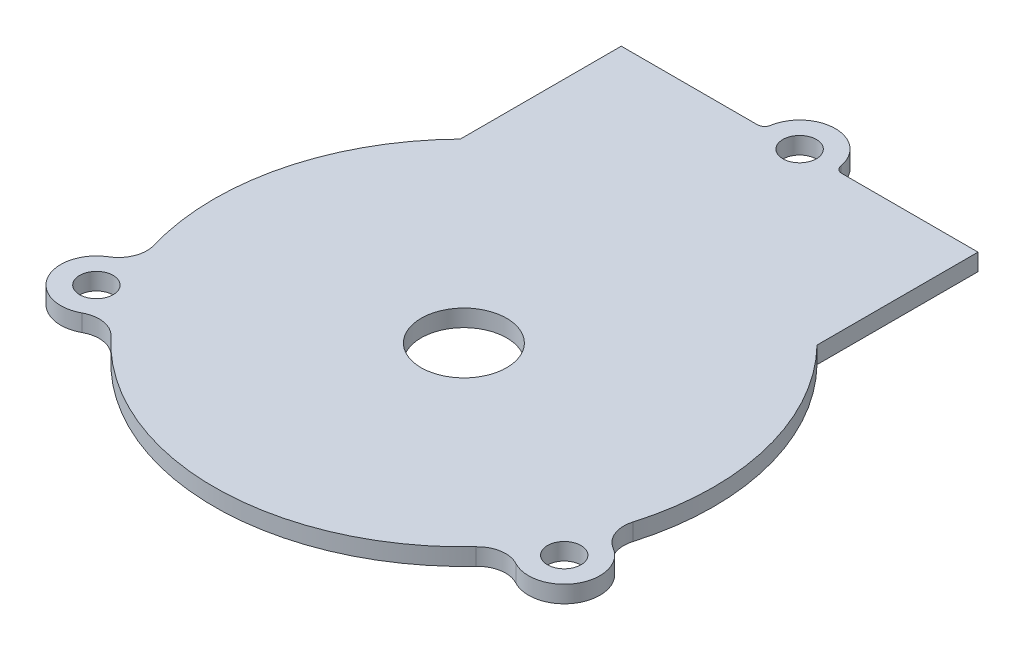
ISO-10303-21;
HEADER;
FILE_DESCRIPTION(('STEP AP214'),'2;1');
FILE_NAME('part.step','',(''),(''),'','','');
FILE_SCHEMA(('AUTOMOTIVE_DESIGN { 1 0 10303 214 1 1 1 1 }'));
ENDSEC;
DATA;
#1=APPLICATION_CONTEXT('core data for automotive mechanical design processes');
#2=APPLICATION_PROTOCOL_DEFINITION('international standard','automotive_design',2000,#1);
#3=PRODUCT_CONTEXT('',#1,'mechanical');
#4=PRODUCT('Part','Part','',(#3));
#5=PRODUCT_RELATED_PRODUCT_CATEGORY('part','',(#4));
#6=PRODUCT_DEFINITION_FORMATION('','',#4);
#7=PRODUCT_DEFINITION_CONTEXT('part definition',#1,'design');
#8=PRODUCT_DEFINITION('design','',#6,#7);
#9=PRODUCT_DEFINITION_SHAPE('','',#8);
#10=(LENGTH_UNIT() NAMED_UNIT(*) SI_UNIT(.MILLI.,.METRE.));
#11=(NAMED_UNIT(*) PLANE_ANGLE_UNIT() SI_UNIT($,.RADIAN.));
#12=(NAMED_UNIT(*) SI_UNIT($,.STERADIAN.) SOLID_ANGLE_UNIT());
#13=UNCERTAINTY_MEASURE_WITH_UNIT(LENGTH_MEASURE(1.E-05),#10,'distance_accuracy_value','');
#14=(GEOMETRIC_REPRESENTATION_CONTEXT(3) GLOBAL_UNCERTAINTY_ASSIGNED_CONTEXT((#13)) GLOBAL_UNIT_ASSIGNED_CONTEXT((#10,
#11,#12)) REPRESENTATION_CONTEXT('',''));
#15=CARTESIAN_POINT('',(0.,0.,0.));
#16=DIRECTION('',(0.,0.,1.));
#17=DIRECTION('',(1.,0.,0.));
#18=AXIS2_PLACEMENT_3D('',#15,#16,#17);
#19=CARTESIAN_POINT('',(32.785,2.38125,-65.7829292065958));
#20=DIRECTION('',(0.,-1.,0.));
#21=DIRECTION('',(0.,0.,-1.));
#22=AXIS2_PLACEMENT_3D('',#19,#20,#21);
#23=CYLINDRICAL_SURFACE('',#22,5.);
#24=CARTESIAN_POINT('',(32.785,2.38125,-65.7829292065958));
#25=DIRECTION('',(0.,1.,0.));
#26=DIRECTION('',(0.,0.,1.));
#27=AXIS2_PLACEMENT_3D('',#24,#25,#26);
#28=CIRCLE('',#27,5.);
#29=CARTESIAN_POINT('',(37.7150664859163,2.38125,-66.6162625399292));
#30=VERTEX_POINT('',#29);
#31=CARTESIAN_POINT('',(27.8549335140836,2.38125,-66.6162625399292));
#32=VERTEX_POINT('',#31);
#33=EDGE_CURVE('E252',#30,#32,#28,.T.);
#34=ORIENTED_EDGE('',*,*,#33,.F.);
#35=DIRECTION('',(0.,-1.,0.));
#36=VECTOR('',#35,1.);
#37=CARTESIAN_POINT('',(37.7150664859163,2.38125,-66.6162625399292));
#38=LINE('',#37,#36);
#39=CARTESIAN_POINT('',(37.7150664859163,0.,-66.6162625399292));
#40=VERTEX_POINT('',#39);
#41=EDGE_CURVE('E289',#30,#40,#38,.T.);
#42=ORIENTED_EDGE('',*,*,#41,.T.);
#43=CARTESIAN_POINT('',(32.785,0.,-65.7829292065958));
#44=DIRECTION('',(0.,1.,0.));
#45=DIRECTION('',(0.,0.,1.));
#46=AXIS2_PLACEMENT_3D('',#43,#44,#45);
#47=CIRCLE('',#46,5.);
#48=CARTESIAN_POINT('',(27.8549335140836,0.,-66.6162625399292));
#49=VERTEX_POINT('',#48);
#50=EDGE_CURVE('E302',#40,#49,#47,.T.);
#51=ORIENTED_EDGE('',*,*,#50,.T.);
#52=DIRECTION('',(0.,-1.,0.));
#53=VECTOR('',#52,1.);
#54=CARTESIAN_POINT('',(27.8549335140836,2.38125,-66.6162625399292));
#55=LINE('',#54,#53);
#56=EDGE_CURVE('E287',#49,#32,#55,.F.);
#57=ORIENTED_EDGE('',*,*,#56,.T.);
#58=EDGE_LOOP('',(#34,#42,#51,#57));
#59=FACE_BOUND('',#58,.T.);
#60=ADVANCED_FACE('F81',(#59),#23,.T.);
#61=CARTESIAN_POINT('',(32.785,0.,-65.7829292065958));
#62=DIRECTION('',(0.,1.,0.));
#63=DIRECTION('',(0.,0.,1.));
#64=AXIS2_PLACEMENT_3D('',#61,#62,#63);
#65=PLANE('',#64);
#66=CARTESIAN_POINT('',(32.785,0.,-65.7829292065958));
#67=DIRECTION('',(0.,1.,0.));
#68=DIRECTION('',(0.,0.,1.));
#69=AXIS2_PLACEMENT_3D('',#66,#67,#68);
#70=CIRCLE('',#69,2.35);
#71=CARTESIAN_POINT('',(32.785,0.,-63.4329292065959));
#72=VERTEX_POINT('',#71);
#73=EDGE_CURVE('E432',#72,#72,#70,.T.);
#74=ORIENTED_EDGE('',*,*,#73,.T.);
#75=EDGE_LOOP('',(#74));
#76=FACE_BOUND('',#75,.T.);
#77=CARTESIAN_POINT('',(0.,0.,0.));
#78=DIRECTION('',(0.,1.,0.));
#79=DIRECTION('',(0.,0.,1.));
#80=AXIS2_PLACEMENT_3D('',#77,#78,#79);
#81=CIRCLE('',#80,2.35);
#82=CARTESIAN_POINT('',(0.,0.,2.35));
#83=VERTEX_POINT('',#82);
#84=EDGE_CURVE('E426',#83,#83,#81,.T.);
#85=ORIENTED_EDGE('',*,*,#84,.T.);
#86=EDGE_LOOP('',(#85));
#87=FACE_BOUND('',#86,.T.);
#88=CARTESIAN_POINT('',(65.57,0.,0.));
#89=DIRECTION('',(0.,1.,0.));
#90=DIRECTION('',(0.,0.,1.));
#91=AXIS2_PLACEMENT_3D('',#88,#89,#90);
#92=CIRCLE('',#91,2.35);
#93=CARTESIAN_POINT('',(65.57,0.,2.35));
#94=VERTEX_POINT('',#93);
#95=EDGE_CURVE('E242',#94,#94,#92,.T.);
#96=ORIENTED_EDGE('',*,*,#95,.T.);
#97=EDGE_LOOP('',(#96));
#98=FACE_BOUND('',#97,.T.);
#99=ORIENTED_EDGE('',*,*,#50,.F.);
#100=CARTESIAN_POINT('',(38.7010797830996,0.,-66.7829292065958));
#101=DIRECTION('',(0.,1.,0.));
#102=DIRECTION('',(0.,0.,1.));
#103=AXIS2_PLACEMENT_3D('',#100,#101,#102);
#104=CIRCLE('',#103,1.);
#105=CARTESIAN_POINT('',(38.7010797830996,0.,-65.7829292065958));
#106=VERTEX_POINT('',#105);
#107=EDGE_CURVE('E295',#40,#106,#104,.T.);
#108=ORIENTED_EDGE('',*,*,#107,.T.);
#109=DIRECTION('',(-1.,0.,0.));
#110=VECTOR('',#109,1.);
#111=CARTESIAN_POINT('',(57.785,0.,-65.7829292065958));
#112=LINE('',#111,#110);
#113=CARTESIAN_POINT('',(57.785,0.,-65.7829292065958));
#114=VERTEX_POINT('',#113);
#115=EDGE_CURVE('E224',#114,#106,#112,.T.);
#116=ORIENTED_EDGE('',*,*,#115,.F.);
#117=DIRECTION('',(0.,0.,1.));
#118=VECTOR('',#117,1.);
#119=CARTESIAN_POINT('',(57.785,0.,-65.7829292065958));
#120=LINE('',#119,#118);
#121=CARTESIAN_POINT('',(57.785,0.,-43.2192120138818));
#122=VERTEX_POINT('',#121);
#123=EDGE_CURVE('E239',#114,#122,#120,.T.);
#124=ORIENTED_EDGE('',*,*,#123,.T.);
#125=CARTESIAN_POINT('',(32.785,0.,-18.72431458605));
#126=DIRECTION('',(0.,1.,0.));
#127=DIRECTION('',(0.,0.,1.));
#128=AXIS2_PLACEMENT_3D('',#125,#126,#127);
#129=CIRCLE('',#128,35.);
#130=CARTESIAN_POINT('',(66.3622838181978,0.,-8.8467637057866));
#131=VERTEX_POINT('',#130);
#132=EDGE_CURVE('E213',#131,#122,#129,.T.);
#133=ORIENTED_EDGE('',*,*,#132,.F.);
#134=CARTESIAN_POINT('',(70.1996876831347,0.,-7.71790074804221));
#135=DIRECTION('',(0.,1.,0.));
#136=DIRECTION('',(0.,0.,1.));
#137=AXIS2_PLACEMENT_3D('',#134,#135,#136);
#138=CIRCLE('',#137,4.);
#139=CARTESIAN_POINT('',(68.1420487128526,0.,-4.28772263780124));
#140=VERTEX_POINT('',#139);
#141=EDGE_CURVE('E263',#131,#140,#138,.T.);
#142=ORIENTED_EDGE('',*,*,#141,.T.);
#143=CARTESIAN_POINT('',(65.57,0.,0.));
#144=DIRECTION('',(0.,1.,0.));
#145=DIRECTION('',(0.,0.,1.));
#146=AXIS2_PLACEMENT_3D('',#143,#144,#145);
#147=CIRCLE('',#146,5.);
#148=CARTESIAN_POINT('',(63.1837861753871,0.,4.39385748326303));
#149=VERTEX_POINT('',#148);
#150=EDGE_CURVE('E217',#149,#140,#147,.T.);
#151=ORIENTED_EDGE('',*,*,#150,.F.);
#152=CARTESIAN_POINT('',(61.2748151156969,0.,7.90894346987345));
#153=DIRECTION('',(0.,1.,0.));
#154=DIRECTION('',(0.,0.,1.));
#155=AXIS2_PLACEMENT_3D('',#152,#153,#154);
#156=CIRCLE('',#155,4.);
#157=CARTESIAN_POINT('',(58.3527827961382,0.,5.17732725900951));
#158=VERTEX_POINT('',#157);
#159=EDGE_CURVE('E260',#149,#158,#156,.T.);
#160=ORIENTED_EDGE('',*,*,#159,.T.);
#161=CARTESIAN_POINT('',(7.21721720386177,0.,5.17732725900952));
#162=VERTEX_POINT('',#161);
#163=EDGE_CURVE('E327',#162,#158,#129,.T.);
#164=ORIENTED_EDGE('',*,*,#163,.F.);
#165=CARTESIAN_POINT('',(4.29518488430312,0.,7.90894346987346));
#166=DIRECTION('',(0.,1.,0.));
#167=DIRECTION('',(0.,0.,1.));
#168=AXIS2_PLACEMENT_3D('',#165,#166,#167);
#169=CIRCLE('',#168,4.);
#170=CARTESIAN_POINT('',(2.38621382461284,0.,4.39385748326303));
#171=VERTEX_POINT('',#170);
#172=EDGE_CURVE('E282',#162,#171,#169,.T.);
#173=ORIENTED_EDGE('',*,*,#172,.T.);
#174=CARTESIAN_POINT('',(0.,0.,0.));
#175=DIRECTION('',(0.,1.,0.));
#176=DIRECTION('',(0.,0.,1.));
#177=AXIS2_PLACEMENT_3D('',#174,#175,#176);
#178=CIRCLE('',#177,5.);
#179=CARTESIAN_POINT('',(-2.57204871285262,0.,-4.28772263780123));
#180=VERTEX_POINT('',#179);
#181=EDGE_CURVE('E233',#180,#171,#178,.T.);
#182=ORIENTED_EDGE('',*,*,#181,.F.);
#183=CARTESIAN_POINT('',(-4.62968768313472,0.,-7.71790074804222));
#184=DIRECTION('',(0.,1.,0.));
#185=DIRECTION('',(0.,0.,1.));
#186=AXIS2_PLACEMENT_3D('',#183,#184,#185);
#187=CIRCLE('',#186,4.);
#188=CARTESIAN_POINT('',(-0.792283818197827,0.,-8.84676370578661));
#189=VERTEX_POINT('',#188);
#190=EDGE_CURVE('E276',#180,#189,#187,.T.);
#191=ORIENTED_EDGE('',*,*,#190,.T.);
#192=CARTESIAN_POINT('',(7.785,0.,-43.2192120138818));
#193=VERTEX_POINT('',#192);
#194=EDGE_CURVE('E206',#193,#189,#129,.T.);
#195=ORIENTED_EDGE('',*,*,#194,.F.);
#196=DIRECTION('',(0.,0.,1.));
#197=VECTOR('',#196,1.);
#198=CARTESIAN_POINT('',(7.78499999999999,0.,-65.7829292065958));
#199=LINE('',#198,#197);
#200=CARTESIAN_POINT('',(7.78499999999999,0.,-65.7829292065958));
#201=VERTEX_POINT('',#200);
#202=EDGE_CURVE('E241',#201,#193,#199,.T.);
#203=ORIENTED_EDGE('',*,*,#202,.F.);
#204=CARTESIAN_POINT('',(26.8689202169004,0.,-65.7829292065958));
#205=VERTEX_POINT('',#204);
#206=EDGE_CURVE('E230',#205,#201,#112,.T.);
#207=ORIENTED_EDGE('',*,*,#206,.F.);
#208=CARTESIAN_POINT('',(26.8689202169004,0.,-66.7829292065958));
#209=DIRECTION('',(0.,1.,0.));
#210=DIRECTION('',(0.,0.,1.));
#211=AXIS2_PLACEMENT_3D('',#208,#209,#210);
#212=CIRCLE('',#211,1.);
#213=EDGE_CURVE('E89',#205,#49,#212,.T.);
#214=ORIENTED_EDGE('',*,*,#213,.T.);
#215=EDGE_LOOP('',(#99,#108,#116,#124,#133,#142,#151,#160,#164,#173,#182,#191,#195,#203,#207,#214));
#216=FACE_BOUND('',#215,.T.);
#217=CARTESIAN_POINT('',(32.785,0.,-18.72431458605));
#218=DIRECTION('',(0.,1.,0.));
#219=DIRECTION('',(0.,0.,1.));
#220=AXIS2_PLACEMENT_3D('',#217,#218,#219);
#221=CIRCLE('',#220,6.);
#222=CARTESIAN_POINT('',(32.785,0.,-12.72431458605));
#223=VERTEX_POINT('',#222);
#224=EDGE_CURVE('E325',#223,#223,#221,.T.);
#225=ORIENTED_EDGE('',*,*,#224,.T.);
#226=EDGE_LOOP('',(#225));
#227=FACE_BOUND('',#226,.T.);
#228=ADVANCED_FACE('F300',(#76,#87,#98,#216,#227),#65,.F.);
#229=CARTESIAN_POINT('',(32.785,2.38125,-65.7829292065958));
#230=DIRECTION('',(0.,1.,0.));
#231=DIRECTION('',(0.,0.,1.));
#232=AXIS2_PLACEMENT_3D('',#229,#230,#231);
#233=PLANE('',#232);
#234=CARTESIAN_POINT('',(32.785,2.38125,-65.7829292065958));
#235=DIRECTION('',(0.,1.,0.));
#236=DIRECTION('',(0.,0.,1.));
#237=AXIS2_PLACEMENT_3D('',#234,#235,#236);
#238=CIRCLE('',#237,2.34999999999999);
#239=CARTESIAN_POINT('',(32.785,2.38125,-63.4329292065959));
#240=VERTEX_POINT('',#239);
#241=EDGE_CURVE('E435',#240,#240,#238,.T.);
#242=ORIENTED_EDGE('',*,*,#241,.F.);
#243=EDGE_LOOP('',(#242));
#244=FACE_BOUND('',#243,.T.);
#245=CARTESIAN_POINT('',(0.,2.38125,0.));
#246=DIRECTION('',(0.,1.,0.));
#247=DIRECTION('',(0.,0.,1.));
#248=AXIS2_PLACEMENT_3D('',#245,#246,#247);
#249=CIRCLE('',#248,2.34999999999999);
#250=CARTESIAN_POINT('',(0.,2.38125,2.34999999999999));
#251=VERTEX_POINT('',#250);
#252=EDGE_CURVE('E429',#251,#251,#249,.T.);
#253=ORIENTED_EDGE('',*,*,#252,.F.);
#254=EDGE_LOOP('',(#253));
#255=FACE_BOUND('',#254,.T.);
#256=CARTESIAN_POINT('',(65.57,2.38125,0.));
#257=DIRECTION('',(0.,1.,0.));
#258=DIRECTION('',(0.,0.,1.));
#259=AXIS2_PLACEMENT_3D('',#256,#257,#258);
#260=CIRCLE('',#259,2.34999999999999);
#261=CARTESIAN_POINT('',(65.57,2.38125,2.34999999999999));
#262=VERTEX_POINT('',#261);
#263=EDGE_CURVE('E423',#262,#262,#260,.T.);
#264=ORIENTED_EDGE('',*,*,#263,.F.);
#265=EDGE_LOOP('',(#264));
#266=FACE_BOUND('',#265,.T.);
#267=DIRECTION('',(-1.,0.,0.));
#268=VECTOR('',#267,1.);
#269=CARTESIAN_POINT('',(57.785,2.38125,-65.7829292065958));
#270=LINE('',#269,#268);
#271=CARTESIAN_POINT('',(57.785,2.38125,-65.7829292065958));
#272=VERTEX_POINT('',#271);
#273=CARTESIAN_POINT('',(38.7010797830996,2.38125,-65.7829292065958));
#274=VERTEX_POINT('',#273);
#275=EDGE_CURVE('E236',#272,#274,#270,.T.);
#276=ORIENTED_EDGE('',*,*,#275,.T.);
#277=CARTESIAN_POINT('',(38.7010797830996,2.38125,-66.7829292065958));
#278=DIRECTION('',(0.,1.,0.));
#279=DIRECTION('',(0.,0.,1.));
#280=AXIS2_PLACEMENT_3D('',#277,#278,#279);
#281=CIRCLE('',#280,1.);
#282=EDGE_CURVE('E293',#274,#30,#281,.F.);
#283=ORIENTED_EDGE('',*,*,#282,.T.);
#284=ORIENTED_EDGE('',*,*,#33,.T.);
#285=CARTESIAN_POINT('',(26.8689202169004,2.38125,-66.7829292065958));
#286=DIRECTION('',(0.,1.,0.));
#287=DIRECTION('',(0.,0.,1.));
#288=AXIS2_PLACEMENT_3D('',#285,#286,#287);
#289=CIRCLE('',#288,1.);
#290=CARTESIAN_POINT('',(26.8689202169004,2.38125,-65.7829292065958));
#291=VERTEX_POINT('',#290);
#292=EDGE_CURVE('E12',#32,#291,#289,.F.);
#293=ORIENTED_EDGE('',*,*,#292,.T.);
#294=CARTESIAN_POINT('',(7.78499999999999,2.38125,-65.7829292065958));
#295=VERTEX_POINT('',#294);
#296=EDGE_CURVE('E227',#291,#295,#270,.T.);
#297=ORIENTED_EDGE('',*,*,#296,.T.);
#298=DIRECTION('',(0.,0.,1.));
#299=VECTOR('',#298,1.);
#300=CARTESIAN_POINT('',(7.78499999999999,2.38125,-65.7829292065958));
#301=LINE('',#300,#299);
#302=CARTESIAN_POINT('',(7.785,2.38125,-43.2192120138818));
#303=VERTEX_POINT('',#302);
#304=EDGE_CURVE('E223',#295,#303,#301,.T.);
#305=ORIENTED_EDGE('',*,*,#304,.T.);
#306=CARTESIAN_POINT('',(32.785,2.38125,-18.72431458605));
#307=DIRECTION('',(0.,1.,0.));
#308=DIRECTION('',(0.,0.,1.));
#309=AXIS2_PLACEMENT_3D('',#306,#307,#308);
#310=CIRCLE('',#309,35.);
#311=CARTESIAN_POINT('',(-0.792283818197827,2.38125,-8.84676370578661));
#312=VERTEX_POINT('',#311);
#313=EDGE_CURVE('E208',#303,#312,#310,.T.);
#314=ORIENTED_EDGE('',*,*,#313,.T.);
#315=CARTESIAN_POINT('',(-4.62968768313472,2.38125,-7.71790074804222));
#316=DIRECTION('',(0.,1.,0.));
#317=DIRECTION('',(0.,0.,1.));
#318=AXIS2_PLACEMENT_3D('',#315,#316,#317);
#319=CIRCLE('',#318,4.);
#320=CARTESIAN_POINT('',(-2.57204871285262,2.38125,-4.28772263780123));
#321=VERTEX_POINT('',#320);
#322=EDGE_CURVE('E278',#312,#321,#319,.F.);
#323=ORIENTED_EDGE('',*,*,#322,.T.);
#324=CARTESIAN_POINT('',(0.,2.38125,0.));
#325=DIRECTION('',(0.,1.,0.));
#326=DIRECTION('',(0.,0.,1.));
#327=AXIS2_PLACEMENT_3D('',#324,#325,#326);
#328=CIRCLE('',#327,5.);
#329=CARTESIAN_POINT('',(2.38621382461284,2.38125,4.39385748326303));
#330=VERTEX_POINT('',#329);
#331=EDGE_CURVE('E329',#321,#330,#328,.T.);
#332=ORIENTED_EDGE('',*,*,#331,.T.);
#333=CARTESIAN_POINT('',(4.29518488430312,2.38125,7.90894346987346));
#334=DIRECTION('',(0.,1.,0.));
#335=DIRECTION('',(0.,0.,1.));
#336=AXIS2_PLACEMENT_3D('',#333,#334,#335);
#337=CIRCLE('',#336,4.);
#338=CARTESIAN_POINT('',(7.21721720386177,2.38125,5.17732725900952));
#339=VERTEX_POINT('',#338);
#340=EDGE_CURVE('E280',#330,#339,#337,.F.);
#341=ORIENTED_EDGE('',*,*,#340,.T.);
#342=CARTESIAN_POINT('',(58.3527827961382,2.38125,5.17732725900951));
#343=VERTEX_POINT('',#342);
#344=EDGE_CURVE('E205',#339,#343,#310,.T.);
#345=ORIENTED_EDGE('',*,*,#344,.T.);
#346=CARTESIAN_POINT('',(61.2748151156969,2.38125,7.90894346987345));
#347=DIRECTION('',(0.,1.,0.));
#348=DIRECTION('',(0.,0.,1.));
#349=AXIS2_PLACEMENT_3D('',#346,#347,#348);
#350=CIRCLE('',#349,4.);
#351=CARTESIAN_POINT('',(63.1837861753871,2.38125,4.39385748326303));
#352=VERTEX_POINT('',#351);
#353=EDGE_CURVE('E258',#343,#352,#350,.F.);
#354=ORIENTED_EDGE('',*,*,#353,.T.);
#355=CARTESIAN_POINT('',(65.57,2.38125,0.));
#356=DIRECTION('',(0.,1.,0.));
#357=DIRECTION('',(0.,0.,1.));
#358=AXIS2_PLACEMENT_3D('',#355,#356,#357);
#359=CIRCLE('',#358,5.);
#360=CARTESIAN_POINT('',(68.1420487128526,2.38125,-4.28772263780124));
#361=VERTEX_POINT('',#360);
#362=EDGE_CURVE('E308',#352,#361,#359,.T.);
#363=ORIENTED_EDGE('',*,*,#362,.T.);
#364=CARTESIAN_POINT('',(70.1996876831347,2.38125,-7.71790074804221));
#365=DIRECTION('',(0.,1.,0.));
#366=DIRECTION('',(0.,0.,1.));
#367=AXIS2_PLACEMENT_3D('',#364,#365,#366);
#368=CIRCLE('',#367,4.);
#369=CARTESIAN_POINT('',(66.3622838181978,2.38125,-8.8467637057866));
#370=VERTEX_POINT('',#369);
#371=EDGE_CURVE('E201',#361,#370,#368,.F.);
#372=ORIENTED_EDGE('',*,*,#371,.T.);
#373=CARTESIAN_POINT('',(57.785,2.38125,-43.2192120138818));
#374=VERTEX_POINT('',#373);
#375=EDGE_CURVE('E192',#370,#374,#310,.T.);
#376=ORIENTED_EDGE('',*,*,#375,.T.);
#377=DIRECTION('',(0.,0.,1.));
#378=VECTOR('',#377,1.);
#379=CARTESIAN_POINT('',(57.785,2.38125,-65.7829292065958));
#380=LINE('',#379,#378);
#381=EDGE_CURVE('E198',#272,#374,#380,.T.);
#382=ORIENTED_EDGE('',*,*,#381,.F.);
#383=EDGE_LOOP('',(#276,#283,#284,#293,#297,#305,#314,#323,#332,#341,#345,#354,#363,#372,#376,#382));
#384=FACE_BOUND('',#383,.T.);
#385=CARTESIAN_POINT('',(32.785,2.38125,-18.72431458605));
#386=DIRECTION('',(0.,1.,0.));
#387=DIRECTION('',(0.,0.,1.));
#388=AXIS2_PLACEMENT_3D('',#385,#386,#387);
#389=CIRCLE('',#388,6.);
#390=CARTESIAN_POINT('',(32.785,2.38125,-12.72431458605));
#391=VERTEX_POINT('',#390);
#392=EDGE_CURVE('E328',#391,#391,#389,.T.);
#393=ORIENTED_EDGE('',*,*,#392,.F.);
#394=EDGE_LOOP('',(#393));
#395=FACE_BOUND('',#394,.T.);
#396=ADVANCED_FACE('F195',(#244,#255,#266,#384,#395),#233,.T.);
#397=CARTESIAN_POINT('',(0.,2.38125,0.));
#398=DIRECTION('',(0.,-1.,0.));
#399=DIRECTION('',(0.,0.,-1.));
#400=AXIS2_PLACEMENT_3D('',#397,#398,#399);
#401=CYLINDRICAL_SURFACE('',#400,5.);
#402=ORIENTED_EDGE('',*,*,#331,.F.);
#403=DIRECTION('',(0.,-1.,0.));
#404=VECTOR('',#403,1.);
#405=CARTESIAN_POINT('',(-2.57204871285262,2.38125,-4.28772263780123));
#406=LINE('',#405,#404);
#407=EDGE_CURVE('E269',#321,#180,#406,.T.);
#408=ORIENTED_EDGE('',*,*,#407,.T.);
#409=ORIENTED_EDGE('',*,*,#181,.T.);
#410=DIRECTION('',(0.,-1.,0.));
#411=VECTOR('',#410,1.);
#412=CARTESIAN_POINT('',(2.38621382461284,2.38125,4.39385748326303));
#413=LINE('',#412,#411);
#414=EDGE_CURVE('E266',#171,#330,#413,.F.);
#415=ORIENTED_EDGE('',*,*,#414,.T.);
#416=EDGE_LOOP('',(#402,#408,#409,#415));
#417=FACE_BOUND('',#416,.T.);
#418=ADVANCED_FACE('F337',(#417),#401,.T.);
#419=CARTESIAN_POINT('',(32.785,2.38125,-18.72431458605));
#420=DIRECTION('',(0.,-1.,0.));
#421=DIRECTION('',(0.,0.,-1.));
#422=AXIS2_PLACEMENT_3D('',#419,#420,#421);
#423=CYLINDRICAL_SURFACE('',#422,35.);
#424=ORIENTED_EDGE('',*,*,#344,.F.);
#425=DIRECTION('',(0.,-1.,0.));
#426=VECTOR('',#425,1.);
#427=CARTESIAN_POINT('',(7.21721720386177,2.38125,5.17732725900951));
#428=LINE('',#427,#426);
#429=EDGE_CURVE('E274',#339,#162,#428,.T.);
#430=ORIENTED_EDGE('',*,*,#429,.T.);
#431=ORIENTED_EDGE('',*,*,#163,.T.);
#432=DIRECTION('',(0.,-1.,0.));
#433=VECTOR('',#432,1.);
#434=CARTESIAN_POINT('',(58.3527827961382,2.38125,5.1773272590095));
#435=LINE('',#434,#433);
#436=EDGE_CURVE('E248',#158,#343,#435,.F.);
#437=ORIENTED_EDGE('',*,*,#436,.T.);
#438=EDGE_LOOP('',(#424,#430,#431,#437));
#439=FACE_BOUND('',#438,.T.);
#440=ADVANCED_FACE('F346',(#439),#423,.T.);
#441=CARTESIAN_POINT('',(32.785,2.38125,-18.72431458605));
#442=DIRECTION('',(0.,-1.,0.));
#443=DIRECTION('',(0.,0.,-1.));
#444=AXIS2_PLACEMENT_3D('',#441,#442,#443);
#445=CYLINDRICAL_SURFACE('',#444,6.);
#446=ORIENTED_EDGE('',*,*,#392,.T.);
#447=EDGE_LOOP('',(#446));
#448=FACE_BOUND('',#447,.T.);
#449=ORIENTED_EDGE('',*,*,#224,.F.);
#450=EDGE_LOOP('',(#449));
#451=FACE_BOUND('',#450,.T.);
#452=ADVANCED_FACE('F365',(#448,#451),#445,.F.);
#453=CARTESIAN_POINT('',(65.57,2.38125,0.));
#454=DIRECTION('',(0.,-1.,0.));
#455=DIRECTION('',(0.,0.,-1.));
#456=AXIS2_PLACEMENT_3D('',#453,#454,#455);
#457=CYLINDRICAL_SURFACE('',#456,5.);
#458=ORIENTED_EDGE('',*,*,#362,.F.);
#459=DIRECTION('',(0.,-1.,0.));
#460=VECTOR('',#459,1.);
#461=CARTESIAN_POINT('',(63.1837861753871,2.38125,4.39385748326303));
#462=LINE('',#461,#460);
#463=EDGE_CURVE('E254',#352,#149,#462,.T.);
#464=ORIENTED_EDGE('',*,*,#463,.T.);
#465=ORIENTED_EDGE('',*,*,#150,.T.);
#466=DIRECTION('',(0.,-1.,0.));
#467=VECTOR('',#466,1.);
#468=CARTESIAN_POINT('',(68.1420487128526,2.38125,-4.28772263780124));
#469=LINE('',#468,#467);
#470=EDGE_CURVE('E251',#140,#361,#469,.F.);
#471=ORIENTED_EDGE('',*,*,#470,.T.);
#472=EDGE_LOOP('',(#458,#464,#465,#471));
#473=FACE_BOUND('',#472,.T.);
#474=ADVANCED_FACE('F355',(#473),#457,.T.);
#475=ORIENTED_EDGE('',*,*,#194,.T.);
#476=DIRECTION('',(0.,-1.,0.));
#477=VECTOR('',#476,1.);
#478=CARTESIAN_POINT('',(-0.792283818197827,2.38125,-8.84676370578661));
#479=LINE('',#478,#477);
#480=EDGE_CURVE('E272',#189,#312,#479,.F.);
#481=ORIENTED_EDGE('',*,*,#480,.T.);
#482=ORIENTED_EDGE('',*,*,#313,.F.);
#483=DIRECTION('',(0.,-1.,0.));
#484=VECTOR('',#483,1.);
#485=CARTESIAN_POINT('',(7.785,2.38125,-43.2192120138818));
#486=LINE('',#485,#484);
#487=EDGE_CURVE('E218',#193,#303,#486,.F.);
#488=ORIENTED_EDGE('',*,*,#487,.F.);
#489=EDGE_LOOP('',(#475,#481,#482,#488));
#490=FACE_BOUND('',#489,.T.);
#491=ADVANCED_FACE('F320',(#490),#423,.T.);
#492=ORIENTED_EDGE('',*,*,#375,.F.);
#493=DIRECTION('',(0.,-1.,0.));
#494=VECTOR('',#493,1.);
#495=CARTESIAN_POINT('',(66.3622838181978,2.38125,-8.8467637057866));
#496=LINE('',#495,#494);
#497=EDGE_CURVE('E256',#370,#131,#496,.T.);
#498=ORIENTED_EDGE('',*,*,#497,.T.);
#499=ORIENTED_EDGE('',*,*,#132,.T.);
#500=DIRECTION('',(0.,-1.,0.));
#501=VECTOR('',#500,1.);
#502=CARTESIAN_POINT('',(57.785,2.38125,-43.2192120138818));
#503=LINE('',#502,#501);
#504=EDGE_CURVE('E210',#122,#374,#503,.F.);
#505=ORIENTED_EDGE('',*,*,#504,.T.);
#506=EDGE_LOOP('',(#492,#498,#499,#505));
#507=FACE_BOUND('',#506,.T.);
#508=ADVANCED_FACE('F211',(#507),#423,.T.);
#509=CARTESIAN_POINT('',(7.78499999999999,2.38125,-65.7829292065958));
#510=DIRECTION('',(1.,0.,0.));
#511=DIRECTION('',(0.,0.,-1.));
#512=AXIS2_PLACEMENT_3D('',#509,#510,#511);
#513=PLANE('',#512);
#514=ORIENTED_EDGE('',*,*,#202,.T.);
#515=ORIENTED_EDGE('',*,*,#487,.T.);
#516=ORIENTED_EDGE('',*,*,#304,.F.);
#517=DIRECTION('',(0.,-1.,0.));
#518=VECTOR('',#517,1.);
#519=CARTESIAN_POINT('',(7.78499999999999,2.38125,-65.7829292065958));
#520=LINE('',#519,#518);
#521=EDGE_CURVE('E238',#295,#201,#520,.T.);
#522=ORIENTED_EDGE('',*,*,#521,.T.);
#523=EDGE_LOOP('',(#514,#515,#516,#522));
#524=FACE_BOUND('',#523,.T.);
#525=ADVANCED_FACE('F392',(#524),#513,.F.);
#526=CARTESIAN_POINT('',(57.785,2.38125,-65.7829292065958));
#527=DIRECTION('',(1.,0.,0.));
#528=DIRECTION('',(0.,0.,-1.));
#529=AXIS2_PLACEMENT_3D('',#526,#527,#528);
#530=PLANE('',#529);
#531=ORIENTED_EDGE('',*,*,#504,.F.);
#532=ORIENTED_EDGE('',*,*,#123,.F.);
#533=DIRECTION('',(0.,-1.,0.));
#534=VECTOR('',#533,1.);
#535=CARTESIAN_POINT('',(57.785,2.38125,-65.7829292065958));
#536=LINE('',#535,#534);
#537=EDGE_CURVE('E221',#272,#114,#536,.T.);
#538=ORIENTED_EDGE('',*,*,#537,.F.);
#539=ORIENTED_EDGE('',*,*,#381,.T.);
#540=EDGE_LOOP('',(#531,#532,#538,#539));
#541=FACE_BOUND('',#540,.T.);
#542=ADVANCED_FACE('F220',(#541),#530,.T.);
#543=CARTESIAN_POINT('',(57.785,2.38125,-65.7829292065958));
#544=DIRECTION('',(0.,0.,1.));
#545=DIRECTION('',(1.,0.,0.));
#546=AXIS2_PLACEMENT_3D('',#543,#544,#545);
#547=PLANE('',#546);
#548=ORIENTED_EDGE('',*,*,#115,.T.);
#549=DIRECTION('',(0.,1.,0.));
#550=VECTOR('',#549,1.);
#551=CARTESIAN_POINT('',(38.7010797830996,2.38125,-65.7829292065958));
#552=LINE('',#551,#550);
#553=EDGE_CURVE('E284',#106,#274,#552,.T.);
#554=ORIENTED_EDGE('',*,*,#553,.T.);
#555=ORIENTED_EDGE('',*,*,#275,.F.);
#556=ORIENTED_EDGE('',*,*,#537,.T.);
#557=EDGE_LOOP('',(#548,#554,#555,#556));
#558=FACE_BOUND('',#557,.T.);
#559=ADVANCED_FACE('F381',(#558),#547,.F.);
#560=ORIENTED_EDGE('',*,*,#296,.F.);
#561=DIRECTION('',(0.,1.,0.));
#562=VECTOR('',#561,1.);
#563=CARTESIAN_POINT('',(26.8689202169004,0.,-65.7829292065958));
#564=LINE('',#563,#562);
#565=EDGE_CURVE('E291',#291,#205,#564,.F.);
#566=ORIENTED_EDGE('',*,*,#565,.T.);
#567=ORIENTED_EDGE('',*,*,#206,.T.);
#568=ORIENTED_EDGE('',*,*,#521,.F.);
#569=EDGE_LOOP('',(#560,#566,#567,#568));
#570=FACE_BOUND('',#569,.T.);
#571=ADVANCED_FACE('F311',(#570),#547,.F.);
#572=CARTESIAN_POINT('',(61.2748151156969,2.38125,7.90894346987345));
#573=DIRECTION('',(0.,-1.,0.));
#574=DIRECTION('',(0.,0.,-1.));
#575=AXIS2_PLACEMENT_3D('',#572,#573,#574);
#576=CYLINDRICAL_SURFACE('',#575,4.);
#577=ORIENTED_EDGE('',*,*,#159,.F.);
#578=ORIENTED_EDGE('',*,*,#463,.F.);
#579=ORIENTED_EDGE('',*,*,#353,.F.);
#580=ORIENTED_EDGE('',*,*,#436,.F.);
#581=EDGE_LOOP('',(#577,#578,#579,#580));
#582=FACE_BOUND('',#581,.T.);
#583=ADVANCED_FACE('F351',(#582),#576,.F.);
#584=CARTESIAN_POINT('',(70.1996876831347,2.38125,-7.71790074804221));
#585=DIRECTION('',(0.,1.,0.));
#586=DIRECTION('',(0.,0.,1.));
#587=AXIS2_PLACEMENT_3D('',#584,#585,#586);
#588=CYLINDRICAL_SURFACE('',#587,4.);
#589=ORIENTED_EDGE('',*,*,#371,.F.);
#590=ORIENTED_EDGE('',*,*,#470,.F.);
#591=ORIENTED_EDGE('',*,*,#141,.F.);
#592=ORIENTED_EDGE('',*,*,#497,.F.);
#593=EDGE_LOOP('',(#589,#590,#591,#592));
#594=FACE_BOUND('',#593,.T.);
#595=ADVANCED_FACE('F401',(#594),#588,.F.);
#596=CARTESIAN_POINT('',(-4.62968768313472,2.38125,-7.71790074804222));
#597=DIRECTION('',(0.,1.,0.));
#598=DIRECTION('',(0.,0.,1.));
#599=AXIS2_PLACEMENT_3D('',#596,#597,#598);
#600=CYLINDRICAL_SURFACE('',#599,4.);
#601=ORIENTED_EDGE('',*,*,#322,.F.);
#602=ORIENTED_EDGE('',*,*,#480,.F.);
#603=ORIENTED_EDGE('',*,*,#190,.F.);
#604=ORIENTED_EDGE('',*,*,#407,.F.);
#605=EDGE_LOOP('',(#601,#602,#603,#604));
#606=FACE_BOUND('',#605,.T.);
#607=ADVANCED_FACE('F404',(#606),#600,.F.);
#608=CARTESIAN_POINT('',(4.29518488430312,2.38125,7.90894346987346));
#609=DIRECTION('',(0.,-1.,0.));
#610=DIRECTION('',(0.,0.,-1.));
#611=AXIS2_PLACEMENT_3D('',#608,#609,#610);
#612=CYLINDRICAL_SURFACE('',#611,4.);
#613=ORIENTED_EDGE('',*,*,#172,.F.);
#614=ORIENTED_EDGE('',*,*,#429,.F.);
#615=ORIENTED_EDGE('',*,*,#340,.F.);
#616=ORIENTED_EDGE('',*,*,#414,.F.);
#617=EDGE_LOOP('',(#613,#614,#615,#616));
#618=FACE_BOUND('',#617,.T.);
#619=ADVANCED_FACE('F341',(#618),#612,.F.);
#620=CARTESIAN_POINT('',(38.7010797830996,2.38125,-66.7829292065958));
#621=DIRECTION('',(0.,-1.,0.));
#622=DIRECTION('',(0.,0.,-1.));
#623=AXIS2_PLACEMENT_3D('',#620,#621,#622);
#624=CYLINDRICAL_SURFACE('',#623,1.);
#625=ORIENTED_EDGE('',*,*,#107,.F.);
#626=ORIENTED_EDGE('',*,*,#41,.F.);
#627=ORIENTED_EDGE('',*,*,#282,.F.);
#628=ORIENTED_EDGE('',*,*,#553,.F.);
#629=EDGE_LOOP('',(#625,#626,#627,#628));
#630=FACE_BOUND('',#629,.T.);
#631=ADVANCED_FACE('F410',(#630),#624,.F.);
#632=CARTESIAN_POINT('',(26.8689202169004,2.38125,-66.7829292065958));
#633=DIRECTION('',(0.,-1.,0.));
#634=DIRECTION('',(0.,0.,-1.));
#635=AXIS2_PLACEMENT_3D('',#632,#633,#634);
#636=CYLINDRICAL_SURFACE('',#635,1.);
#637=ORIENTED_EDGE('',*,*,#292,.F.);
#638=ORIENTED_EDGE('',*,*,#56,.F.);
#639=ORIENTED_EDGE('',*,*,#213,.F.);
#640=ORIENTED_EDGE('',*,*,#565,.F.);
#641=EDGE_LOOP('',(#637,#638,#639,#640));
#642=FACE_BOUND('',#641,.T.);
#643=ADVANCED_FACE('F83',(#642),#636,.F.);
#644=CARTESIAN_POINT('',(65.57,2.38125,0.));
#645=DIRECTION('',(0.,1.,0.));
#646=DIRECTION('',(0.,0.,1.));
#647=AXIS2_PLACEMENT_3D('',#644,#645,#646);
#648=CYLINDRICAL_SURFACE('',#647,2.35);
#649=ORIENTED_EDGE('',*,*,#95,.F.);
#650=EDGE_LOOP('',(#649));
#651=FACE_BOUND('',#650,.T.);
#652=ORIENTED_EDGE('',*,*,#263,.T.);
#653=EDGE_LOOP('',(#652));
#654=FACE_BOUND('',#653,.T.);
#655=ADVANCED_FACE('F416',(#651,#654),#648,.F.);
#656=CARTESIAN_POINT('',(0.,2.38125,0.));
#657=DIRECTION('',(0.,1.,0.));
#658=DIRECTION('',(0.,0.,1.));
#659=AXIS2_PLACEMENT_3D('',#656,#657,#658);
#660=CYLINDRICAL_SURFACE('',#659,2.34999999999999);
#661=ORIENTED_EDGE('',*,*,#84,.F.);
#662=EDGE_LOOP('',(#661));
#663=FACE_BOUND('',#662,.T.);
#664=ORIENTED_EDGE('',*,*,#252,.T.);
#665=EDGE_LOOP('',(#664));
#666=FACE_BOUND('',#665,.T.);
#667=ADVANCED_FACE('F440',(#663,#666),#660,.F.);
#668=CARTESIAN_POINT('',(32.785,2.38125,-65.7829292065958));
#669=DIRECTION('',(0.,1.,0.));
#670=DIRECTION('',(0.,0.,1.));
#671=AXIS2_PLACEMENT_3D('',#668,#669,#670);
#672=CYLINDRICAL_SURFACE('',#671,2.34999999999999);
#673=ORIENTED_EDGE('',*,*,#73,.F.);
#674=EDGE_LOOP('',(#673));
#675=FACE_BOUND('',#674,.T.);
#676=ORIENTED_EDGE('',*,*,#241,.T.);
#677=EDGE_LOOP('',(#676));
#678=FACE_BOUND('',#677,.T.);
#679=ADVANCED_FACE('F438',(#675,#678),#672,.F.);
#680=CLOSED_SHELL('',(#60,#228,#396,#418,#440,#452,#474,#491,#508,#525,#542,#559,#571,#583,#595,
#607,#619,#631,#643,#655,#667,#679));
#681=MANIFOLD_SOLID_BREP('B2',#680);
#682=ADVANCED_BREP_SHAPE_REPRESENTATION('',(#18,#681),#14);
#683=SHAPE_DEFINITION_REPRESENTATION(#9,#682);
ENDSEC;
END-ISO-10303-21;
